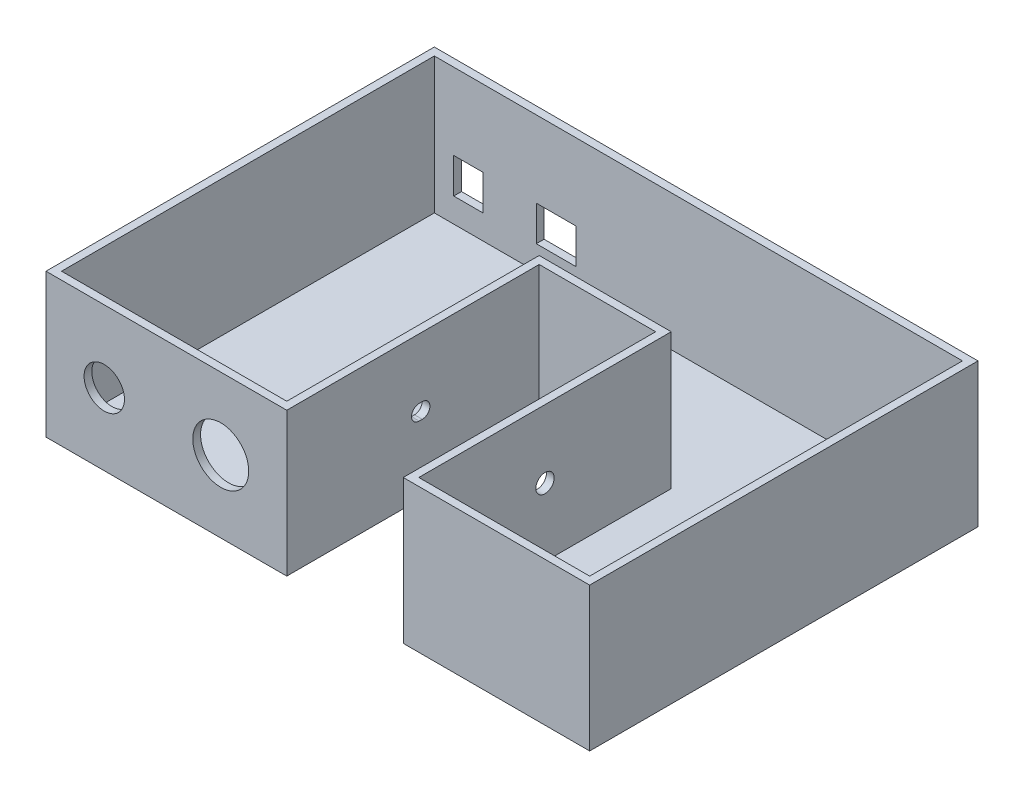
ISO-10303-21;
HEADER;
FILE_DESCRIPTION(('STEP AP214'),'2;1');
FILE_NAME('part.step','',(''),(''),'','','');
FILE_SCHEMA(('AUTOMOTIVE_DESIGN { 1 0 10303 214 1 1 1 1 }'));
ENDSEC;
DATA;
#1=APPLICATION_CONTEXT('core data for automotive mechanical design processes');
#2=APPLICATION_PROTOCOL_DEFINITION('international standard','automotive_design',2000,#1);
#3=PRODUCT_CONTEXT('',#1,'mechanical');
#4=PRODUCT('Part','Part','',(#3));
#5=PRODUCT_RELATED_PRODUCT_CATEGORY('part','',(#4));
#6=PRODUCT_DEFINITION_FORMATION('','',#4);
#7=PRODUCT_DEFINITION_CONTEXT('part definition',#1,'design');
#8=PRODUCT_DEFINITION('design','',#6,#7);
#9=PRODUCT_DEFINITION_SHAPE('','',#8);
#10=(LENGTH_UNIT() NAMED_UNIT(*) SI_UNIT(.MILLI.,.METRE.));
#11=(NAMED_UNIT(*) PLANE_ANGLE_UNIT() SI_UNIT($,.RADIAN.));
#12=(NAMED_UNIT(*) SI_UNIT($,.STERADIAN.) SOLID_ANGLE_UNIT());
#13=UNCERTAINTY_MEASURE_WITH_UNIT(LENGTH_MEASURE(1.E-05),#10,'distance_accuracy_value','');
#14=(GEOMETRIC_REPRESENTATION_CONTEXT(3) GLOBAL_UNCERTAINTY_ASSIGNED_CONTEXT((#13)) GLOBAL_UNIT_ASSIGNED_CONTEXT((#10,
#11,#12)) REPRESENTATION_CONTEXT('',''));
#15=CARTESIAN_POINT('',(0.,0.,0.));
#16=DIRECTION('',(0.,0.,1.));
#17=DIRECTION('',(1.,0.,0.));
#18=AXIS2_PLACEMENT_3D('',#15,#16,#17);
#19=CARTESIAN_POINT('',(0.,2.54,0.));
#20=DIRECTION('',(0.,0.,-1.));
#21=DIRECTION('',(-1.,0.,0.));
#22=AXIS2_PLACEMENT_3D('',#19,#20,#21);
#23=PLANE('',#22);
#24=CARTESIAN_POINT('',(19.05,23.495,0.));
#25=DIRECTION('',(0.,0.,1.));
#26=DIRECTION('',(1.,0.,0.));
#27=AXIS2_PLACEMENT_3D('',#24,#25,#26);
#28=CIRCLE('',#27,6.604);
#29=CARTESIAN_POINT('',(25.654,23.495,0.));
#30=VERTEX_POINT('',#29);
#31=EDGE_CURVE('E582',#30,#30,#28,.T.);
#32=ORIENTED_EDGE('',*,*,#31,.F.);
#33=EDGE_LOOP('',(#32));
#34=FACE_BOUND('',#33,.T.);
#35=CARTESIAN_POINT('',(57.15,23.495,0.));
#36=DIRECTION('',(0.,0.,1.));
#37=DIRECTION('',(1.,0.,0.));
#38=AXIS2_PLACEMENT_3D('',#35,#36,#37);
#39=CIRCLE('',#38,9.14400000000001);
#40=CARTESIAN_POINT('',(66.294,23.495,0.));
#41=VERTEX_POINT('',#40);
#42=EDGE_CURVE('E584',#41,#41,#39,.T.);
#43=ORIENTED_EDGE('',*,*,#42,.F.);
#44=EDGE_LOOP('',(#43));
#45=FACE_BOUND('',#44,.T.);
#46=DIRECTION('',(1.,0.,0.));
#47=VECTOR('',#46,1.);
#48=CARTESIAN_POINT('',(0.,0.,0.));
#49=LINE('',#48,#47);
#50=CARTESIAN_POINT('',(0.,0.,0.));
#51=VERTEX_POINT('',#50);
#52=CARTESIAN_POINT('',(78.74,0.,0.));
#53=VERTEX_POINT('',#52);
#54=EDGE_CURVE('E393',#51,#53,#49,.T.);
#55=ORIENTED_EDGE('',*,*,#54,.T.);
#56=DIRECTION('',(0.,-1.,0.));
#57=VECTOR('',#56,1.);
#58=CARTESIAN_POINT('',(78.74,2.54,0.));
#59=LINE('',#58,#57);
#60=CARTESIAN_POINT('',(78.74,46.99,0.));
#61=VERTEX_POINT('',#60);
#62=EDGE_CURVE('E11',#61,#53,#59,.T.);
#63=ORIENTED_EDGE('',*,*,#62,.F.);
#64=DIRECTION('',(1.,0.,0.));
#65=VECTOR('',#64,1.);
#66=CARTESIAN_POINT('',(0.,46.99,0.));
#67=LINE('',#66,#65);
#68=CARTESIAN_POINT('',(0.,46.99,0.));
#69=VERTEX_POINT('',#68);
#70=EDGE_CURVE('E375',#69,#61,#67,.T.);
#71=ORIENTED_EDGE('',*,*,#70,.F.);
#72=DIRECTION('',(0.,-1.,0.));
#73=VECTOR('',#72,1.);
#74=CARTESIAN_POINT('',(0.,2.54,0.));
#75=LINE('',#74,#73);
#76=EDGE_CURVE('E414',#69,#51,#75,.T.);
#77=ORIENTED_EDGE('',*,*,#76,.T.);
#78=EDGE_LOOP('',(#55,#63,#71,#77));
#79=FACE_BOUND('',#78,.T.);
#80=ADVANCED_FACE('F35',(#34,#45,#79),#23,.F.);
#81=CARTESIAN_POINT('',(78.74,2.54,0.));
#82=DIRECTION('',(-1.,0.,0.));
#83=DIRECTION('',(0.,0.,1.));
#84=AXIS2_PLACEMENT_3D('',#81,#82,#83);
#85=PLANE('',#84);
#86=DIRECTION('',(0.,0.,1.));
#87=VECTOR('',#86,1.);
#88=CARTESIAN_POINT('',(78.74,27.265,-44.315));
#89=LINE('',#88,#87);
#90=CARTESIAN_POINT('',(78.74,27.265,-44.315));
#91=VERTEX_POINT('',#90);
#92=CARTESIAN_POINT('',(78.74,27.265,-43.315));
#93=VERTEX_POINT('',#92);
#94=EDGE_CURVE('E223',#91,#93,#89,.T.);
#95=ORIENTED_EDGE('',*,*,#94,.F.);
#96=CARTESIAN_POINT('',(78.74,24.765,-44.315));
#97=DIRECTION('',(-1.,0.,0.));
#98=DIRECTION('',(0.,0.,1.));
#99=AXIS2_PLACEMENT_3D('',#96,#97,#98);
#100=CIRCLE('',#99,2.5);
#101=CARTESIAN_POINT('',(78.74,22.265,-44.315));
#102=VERTEX_POINT('',#101);
#103=EDGE_CURVE('E230',#102,#91,#100,.F.);
#104=ORIENTED_EDGE('',*,*,#103,.F.);
#105=DIRECTION('',(0.,0.,-1.));
#106=VECTOR('',#105,1.);
#107=CARTESIAN_POINT('',(78.74,22.265,-44.315));
#108=LINE('',#107,#106);
#109=CARTESIAN_POINT('',(78.74,22.265,-43.315));
#110=VERTEX_POINT('',#109);
#111=EDGE_CURVE('E235',#110,#102,#108,.T.);
#112=ORIENTED_EDGE('',*,*,#111,.F.);
#113=CARTESIAN_POINT('',(78.74,24.765,-43.315));
#114=DIRECTION('',(-1.,0.,0.));
#115=DIRECTION('',(0.,0.,1.));
#116=AXIS2_PLACEMENT_3D('',#113,#114,#115);
#117=CIRCLE('',#116,2.5);
#118=EDGE_CURVE('E49',#93,#110,#117,.F.);
#119=ORIENTED_EDGE('',*,*,#118,.F.);
#120=EDGE_LOOP('',(#95,#104,#112,#119));
#121=FACE_BOUND('',#120,.T.);
#122=DIRECTION('',(0.,0.,-1.));
#123=VECTOR('',#122,1.);
#124=CARTESIAN_POINT('',(78.74,0.,0.));
#125=LINE('',#124,#123);
#126=CARTESIAN_POINT('',(78.74,0.,-82.55));
#127=VERTEX_POINT('',#126);
#128=EDGE_CURVE('E396',#53,#127,#125,.T.);
#129=ORIENTED_EDGE('',*,*,#128,.T.);
#130=DIRECTION('',(0.,-1.,0.));
#131=VECTOR('',#130,1.);
#132=CARTESIAN_POINT('',(78.74,2.54,-82.55));
#133=LINE('',#132,#131);
#134=CARTESIAN_POINT('',(78.74,46.99,-82.55));
#135=VERTEX_POINT('',#134);
#136=EDGE_CURVE('E42',#135,#127,#133,.T.);
#137=ORIENTED_EDGE('',*,*,#136,.F.);
#138=DIRECTION('',(0.,0.,-1.));
#139=VECTOR('',#138,1.);
#140=CARTESIAN_POINT('',(78.74,46.99,0.));
#141=LINE('',#140,#139);
#142=EDGE_CURVE('E378',#61,#135,#141,.T.);
#143=ORIENTED_EDGE('',*,*,#142,.F.);
#144=ORIENTED_EDGE('',*,*,#62,.T.);
#145=EDGE_LOOP('',(#129,#137,#143,#144));
#146=FACE_BOUND('',#145,.T.);
#147=ADVANCED_FACE('F237',(#121,#146),#85,.F.);
#148=CARTESIAN_POINT('',(0.,2.54,-82.55));
#149=DIRECTION('',(0.,0.,-1.));
#150=DIRECTION('',(-1.,0.,0.));
#151=AXIS2_PLACEMENT_3D('',#148,#149,#150);
#152=PLANE('',#151);
#153=DIRECTION('',(1.,0.,0.));
#154=VECTOR('',#153,1.);
#155=CARTESIAN_POINT('',(0.,0.,-82.55));
#156=LINE('',#155,#154);
#157=CARTESIAN_POINT('',(116.84,0.,-82.55));
#158=VERTEX_POINT('',#157);
#159=EDGE_CURVE('E398',#127,#158,#156,.T.);
#160=ORIENTED_EDGE('',*,*,#159,.T.);
#161=DIRECTION('',(0.,-1.,0.));
#162=VECTOR('',#161,1.);
#163=CARTESIAN_POINT('',(116.84,2.54,-82.55));
#164=LINE('',#163,#162);
#165=CARTESIAN_POINT('',(116.84,46.99,-82.55));
#166=VERTEX_POINT('',#165);
#167=EDGE_CURVE('E425',#166,#158,#164,.T.);
#168=ORIENTED_EDGE('',*,*,#167,.F.);
#169=DIRECTION('',(1.,0.,0.));
#170=VECTOR('',#169,1.);
#171=CARTESIAN_POINT('',(78.74,46.99,-82.55));
#172=LINE('',#171,#170);
#173=EDGE_CURVE('E381',#135,#166,#172,.T.);
#174=ORIENTED_EDGE('',*,*,#173,.F.);
#175=ORIENTED_EDGE('',*,*,#136,.T.);
#176=EDGE_LOOP('',(#160,#168,#174,#175));
#177=FACE_BOUND('',#176,.T.);
#178=ADVANCED_FACE('F431',(#177),#152,.F.);
#179=CARTESIAN_POINT('',(116.84,2.54,0.));
#180=DIRECTION('',(1.,0.,0.));
#181=DIRECTION('',(0.,0.,-1.));
#182=AXIS2_PLACEMENT_3D('',#179,#180,#181);
#183=PLANE('',#182);
#184=CARTESIAN_POINT('',(116.84,24.765,-43.815));
#185=DIRECTION('',(1.,0.,0.));
#186=DIRECTION('',(0.,0.,-1.));
#187=AXIS2_PLACEMENT_3D('',#184,#185,#186);
#188=CIRCLE('',#187,3.);
#189=CARTESIAN_POINT('',(116.84,24.765,-46.8150000000001));
#190=VERTEX_POINT('',#189);
#191=EDGE_CURVE('E244',#190,#190,#188,.F.);
#192=ORIENTED_EDGE('',*,*,#191,.F.);
#193=EDGE_LOOP('',(#192));
#194=FACE_BOUND('',#193,.T.);
#195=DIRECTION('',(0.,0.,1.));
#196=VECTOR('',#195,1.);
#197=CARTESIAN_POINT('',(116.84,0.,0.));
#198=LINE('',#197,#196);
#199=CARTESIAN_POINT('',(116.84,0.,0.));
#200=VERTEX_POINT('',#199);
#201=EDGE_CURVE('E400',#158,#200,#198,.T.);
#202=ORIENTED_EDGE('',*,*,#201,.T.);
#203=DIRECTION('',(0.,-1.,0.));
#204=VECTOR('',#203,1.);
#205=CARTESIAN_POINT('',(116.84,2.54,0.));
#206=LINE('',#205,#204);
#207=CARTESIAN_POINT('',(116.84,46.99,0.));
#208=VERTEX_POINT('',#207);
#209=EDGE_CURVE('E422',#208,#200,#206,.T.);
#210=ORIENTED_EDGE('',*,*,#209,.F.);
#211=DIRECTION('',(0.,0.,1.));
#212=VECTOR('',#211,1.);
#213=CARTESIAN_POINT('',(116.84,46.99,-82.55));
#214=LINE('',#213,#212);
#215=EDGE_CURVE('E384',#166,#208,#214,.T.);
#216=ORIENTED_EDGE('',*,*,#215,.F.);
#217=ORIENTED_EDGE('',*,*,#167,.T.);
#218=EDGE_LOOP('',(#202,#210,#216,#217));
#219=FACE_BOUND('',#218,.T.);
#220=ADVANCED_FACE('F439',(#194,#219),#183,.F.);
#221=CARTESIAN_POINT('',(0.,2.54,0.));
#222=DIRECTION('',(0.,0.,-1.));
#223=DIRECTION('',(-1.,0.,0.));
#224=AXIS2_PLACEMENT_3D('',#221,#222,#223);
#225=PLANE('',#224);
#226=DIRECTION('',(1.,0.,0.));
#227=VECTOR('',#226,1.);
#228=CARTESIAN_POINT('',(0.,0.,0.));
#229=LINE('',#228,#227);
#230=CARTESIAN_POINT('',(177.8,0.,0.));
#231=VERTEX_POINT('',#230);
#232=EDGE_CURVE('E402',#200,#231,#229,.T.);
#233=ORIENTED_EDGE('',*,*,#232,.T.);
#234=DIRECTION('',(0.,-1.,0.));
#235=VECTOR('',#234,1.);
#236=CARTESIAN_POINT('',(177.8,2.54,0.));
#237=LINE('',#236,#235);
#238=CARTESIAN_POINT('',(177.8,46.99,0.));
#239=VERTEX_POINT('',#238);
#240=EDGE_CURVE('E420',#239,#231,#237,.T.);
#241=ORIENTED_EDGE('',*,*,#240,.F.);
#242=DIRECTION('',(1.,0.,0.));
#243=VECTOR('',#242,1.);
#244=CARTESIAN_POINT('',(116.84,46.99,0.));
#245=LINE('',#244,#243);
#246=EDGE_CURVE('E387',#208,#239,#245,.T.);
#247=ORIENTED_EDGE('',*,*,#246,.F.);
#248=ORIENTED_EDGE('',*,*,#209,.T.);
#249=EDGE_LOOP('',(#233,#241,#247,#248));
#250=FACE_BOUND('',#249,.T.);
#251=ADVANCED_FACE('F443',(#250),#225,.F.);
#252=CARTESIAN_POINT('',(177.8,2.54,0.));
#253=DIRECTION('',(1.,0.,0.));
#254=DIRECTION('',(0.,0.,-1.));
#255=AXIS2_PLACEMENT_3D('',#252,#253,#254);
#256=PLANE('',#255);
#257=DIRECTION('',(0.,0.,1.));
#258=VECTOR('',#257,1.);
#259=CARTESIAN_POINT('',(177.8,0.,0.));
#260=LINE('',#259,#258);
#261=CARTESIAN_POINT('',(177.8,0.,-127.));
#262=VERTEX_POINT('',#261);
#263=EDGE_CURVE('E405',#262,#231,#260,.T.);
#264=ORIENTED_EDGE('',*,*,#263,.F.);
#265=DIRECTION('',(0.,-1.,0.));
#266=VECTOR('',#265,1.);
#267=CARTESIAN_POINT('',(177.8,2.54,-127.));
#268=LINE('',#267,#266);
#269=CARTESIAN_POINT('',(177.8,46.99,-127.));
#270=VERTEX_POINT('',#269);
#271=EDGE_CURVE('E418',#270,#262,#268,.T.);
#272=ORIENTED_EDGE('',*,*,#271,.F.);
#273=DIRECTION('',(0.,0.,-1.));
#274=VECTOR('',#273,1.);
#275=CARTESIAN_POINT('',(177.8,46.99,0.));
#276=LINE('',#275,#274);
#277=EDGE_CURVE('E390',#239,#270,#276,.T.);
#278=ORIENTED_EDGE('',*,*,#277,.F.);
#279=ORIENTED_EDGE('',*,*,#240,.T.);
#280=EDGE_LOOP('',(#264,#272,#278,#279));
#281=FACE_BOUND('',#280,.T.);
#282=ADVANCED_FACE('F451',(#281),#256,.T.);
#283=CARTESIAN_POINT('',(0.,2.54,-127.));
#284=DIRECTION('',(0.,0.,-1.));
#285=DIRECTION('',(-1.,0.,0.));
#286=AXIS2_PLACEMENT_3D('',#283,#284,#285);
#287=PLANE('',#286);
#288=DIRECTION('',(1.,0.,0.));
#289=VECTOR('',#288,1.);
#290=CARTESIAN_POINT('',(35.89,21.99,-127.));
#291=LINE('',#290,#289);
#292=CARTESIAN_POINT('',(35.89,21.99,-127.));
#293=VERTEX_POINT('',#292);
#294=CARTESIAN_POINT('',(48.89,21.99,-127.));
#295=VERTEX_POINT('',#294);
#296=EDGE_CURVE('E260',#293,#295,#291,.T.);
#297=ORIENTED_EDGE('',*,*,#296,.F.);
#298=DIRECTION('',(0.,1.,0.));
#299=VECTOR('',#298,1.);
#300=CARTESIAN_POINT('',(35.89,10.49,-127.));
#301=LINE('',#300,#299);
#302=CARTESIAN_POINT('',(35.89,10.49,-127.));
#303=VERTEX_POINT('',#302);
#304=EDGE_CURVE('E257',#303,#293,#301,.T.);
#305=ORIENTED_EDGE('',*,*,#304,.F.);
#306=DIRECTION('',(-1.,0.,0.));
#307=VECTOR('',#306,1.);
#308=CARTESIAN_POINT('',(35.89,10.49,-127.));
#309=LINE('',#308,#307);
#310=CARTESIAN_POINT('',(48.89,10.49,-127.));
#311=VERTEX_POINT('',#310);
#312=EDGE_CURVE('E266',#311,#303,#309,.T.);
#313=ORIENTED_EDGE('',*,*,#312,.F.);
#314=DIRECTION('',(0.,-1.,0.));
#315=VECTOR('',#314,1.);
#316=CARTESIAN_POINT('',(48.89,10.49,-127.));
#317=LINE('',#316,#315);
#318=EDGE_CURVE('E263',#295,#311,#317,.T.);
#319=ORIENTED_EDGE('',*,*,#318,.F.);
#320=EDGE_LOOP('',(#297,#305,#313,#319));
#321=FACE_BOUND('',#320,.T.);
#322=DIRECTION('',(1.,0.,0.));
#323=VECTOR('',#322,1.);
#324=CARTESIAN_POINT('',(8.89000000000001,21.99,-127.));
#325=LINE('',#324,#323);
#326=CARTESIAN_POINT('',(8.89000000000001,21.99,-127.));
#327=VERTEX_POINT('',#326);
#328=CARTESIAN_POINT('',(18.39,21.99,-127.));
#329=VERTEX_POINT('',#328);
#330=EDGE_CURVE('E292',#327,#329,#325,.T.);
#331=ORIENTED_EDGE('',*,*,#330,.F.);
#332=DIRECTION('',(0.,1.,0.));
#333=VECTOR('',#332,1.);
#334=CARTESIAN_POINT('',(8.89000000000001,21.99,-127.));
#335=LINE('',#334,#333);
#336=CARTESIAN_POINT('',(8.89000000000001,10.49,-127.));
#337=VERTEX_POINT('',#336);
#338=EDGE_CURVE('E289',#337,#327,#335,.T.);
#339=ORIENTED_EDGE('',*,*,#338,.F.);
#340=DIRECTION('',(-1.,0.,0.));
#341=VECTOR('',#340,1.);
#342=CARTESIAN_POINT('',(8.89000000000001,10.49,-127.));
#343=LINE('',#342,#341);
#344=CARTESIAN_POINT('',(18.39,10.49,-127.));
#345=VERTEX_POINT('',#344);
#346=EDGE_CURVE('E298',#345,#337,#343,.T.);
#347=ORIENTED_EDGE('',*,*,#346,.F.);
#348=DIRECTION('',(0.,-1.,0.));
#349=VECTOR('',#348,1.);
#350=CARTESIAN_POINT('',(18.39,21.99,-127.));
#351=LINE('',#350,#349);
#352=EDGE_CURVE('E295',#329,#345,#351,.T.);
#353=ORIENTED_EDGE('',*,*,#352,.F.);
#354=EDGE_LOOP('',(#331,#339,#347,#353));
#355=FACE_BOUND('',#354,.T.);
#356=DIRECTION('',(1.,0.,0.));
#357=VECTOR('',#356,1.);
#358=CARTESIAN_POINT('',(0.,0.,-127.));
#359=LINE('',#358,#357);
#360=CARTESIAN_POINT('',(0.,0.,-127.));
#361=VERTEX_POINT('',#360);
#362=EDGE_CURVE('E408',#361,#262,#359,.T.);
#363=ORIENTED_EDGE('',*,*,#362,.F.);
#364=DIRECTION('',(0.,-1.,0.));
#365=VECTOR('',#364,1.);
#366=CARTESIAN_POINT('',(0.,2.54,-127.));
#367=LINE('',#366,#365);
#368=CARTESIAN_POINT('',(0.,46.99,-127.));
#369=VERTEX_POINT('',#368);
#370=EDGE_CURVE('E416',#369,#361,#367,.T.);
#371=ORIENTED_EDGE('',*,*,#370,.F.);
#372=DIRECTION('',(-1.,0.,0.));
#373=VECTOR('',#372,1.);
#374=CARTESIAN_POINT('',(177.8,46.99,-127.));
#375=LINE('',#374,#373);
#376=EDGE_CURVE('E369',#270,#369,#375,.T.);
#377=ORIENTED_EDGE('',*,*,#376,.F.);
#378=ORIENTED_EDGE('',*,*,#271,.T.);
#379=EDGE_LOOP('',(#363,#371,#377,#378));
#380=FACE_BOUND('',#379,.T.);
#381=ADVANCED_FACE('F454',(#321,#355,#380),#287,.T.);
#382=CARTESIAN_POINT('',(0.,2.54,0.));
#383=DIRECTION('',(-1.,0.,0.));
#384=DIRECTION('',(0.,0.,1.));
#385=AXIS2_PLACEMENT_3D('',#382,#383,#384);
#386=PLANE('',#385);
#387=DIRECTION('',(0.,0.,-1.));
#388=VECTOR('',#387,1.);
#389=CARTESIAN_POINT('',(0.,0.,0.));
#390=LINE('',#389,#388);
#391=EDGE_CURVE('E411',#51,#361,#390,.T.);
#392=ORIENTED_EDGE('',*,*,#391,.F.);
#393=ORIENTED_EDGE('',*,*,#76,.F.);
#394=DIRECTION('',(0.,0.,1.));
#395=VECTOR('',#394,1.);
#396=CARTESIAN_POINT('',(0.,46.99,-127.));
#397=LINE('',#396,#395);
#398=EDGE_CURVE('E372',#369,#69,#397,.T.);
#399=ORIENTED_EDGE('',*,*,#398,.F.);
#400=ORIENTED_EDGE('',*,*,#370,.T.);
#401=EDGE_LOOP('',(#392,#393,#399,#400));
#402=FACE_BOUND('',#401,.T.);
#403=ADVANCED_FACE('F476',(#402),#386,.T.);
#404=CARTESIAN_POINT('',(0.,0.,0.));
#405=DIRECTION('',(0.,1.,0.));
#406=DIRECTION('',(0.,0.,1.));
#407=AXIS2_PLACEMENT_3D('',#404,#405,#406);
#408=PLANE('',#407);
#409=ORIENTED_EDGE('',*,*,#54,.F.);
#410=ORIENTED_EDGE('',*,*,#391,.T.);
#411=ORIENTED_EDGE('',*,*,#362,.T.);
#412=ORIENTED_EDGE('',*,*,#263,.T.);
#413=ORIENTED_EDGE('',*,*,#232,.F.);
#414=ORIENTED_EDGE('',*,*,#201,.F.);
#415=ORIENTED_EDGE('',*,*,#159,.F.);
#416=ORIENTED_EDGE('',*,*,#128,.F.);
#417=EDGE_LOOP('',(#409,#410,#411,#412,#413,#414,#415,#416));
#418=FACE_BOUND('',#417,.T.);
#419=ADVANCED_FACE('F436',(#418),#408,.F.);
#420=CARTESIAN_POINT('',(0.,46.99,0.));
#421=DIRECTION('',(0.,1.,0.));
#422=DIRECTION('',(0.,0.,1.));
#423=AXIS2_PLACEMENT_3D('',#420,#421,#422);
#424=PLANE('',#423);
#425=ORIENTED_EDGE('',*,*,#376,.T.);
#426=ORIENTED_EDGE('',*,*,#398,.T.);
#427=ORIENTED_EDGE('',*,*,#70,.T.);
#428=ORIENTED_EDGE('',*,*,#142,.T.);
#429=ORIENTED_EDGE('',*,*,#173,.T.);
#430=ORIENTED_EDGE('',*,*,#215,.T.);
#431=ORIENTED_EDGE('',*,*,#246,.T.);
#432=ORIENTED_EDGE('',*,*,#277,.T.);
#433=EDGE_LOOP('',(#425,#426,#427,#428,#429,#430,#431,#432));
#434=FACE_BOUND('',#433,.T.);
#435=DIRECTION('',(1.,0.,0.));
#436=VECTOR('',#435,1.);
#437=CARTESIAN_POINT('',(2.54000000000001,46.99,-2.54));
#438=LINE('',#437,#436);
#439=CARTESIAN_POINT('',(2.54000000000001,46.99,-2.54));
#440=VERTEX_POINT('',#439);
#441=CARTESIAN_POINT('',(76.2,46.99,-2.54));
#442=VERTEX_POINT('',#441);
#443=EDGE_CURVE('E315',#440,#442,#438,.T.);
#444=ORIENTED_EDGE('',*,*,#443,.F.);
#445=DIRECTION('',(0.,0.,1.));
#446=VECTOR('',#445,1.);
#447=CARTESIAN_POINT('',(2.54,46.99,-124.46));
#448=LINE('',#447,#446);
#449=CARTESIAN_POINT('',(2.54,46.99,-124.46));
#450=VERTEX_POINT('',#449);
#451=EDGE_CURVE('E313',#450,#440,#448,.T.);
#452=ORIENTED_EDGE('',*,*,#451,.F.);
#453=DIRECTION('',(-1.,0.,0.));
#454=VECTOR('',#453,1.);
#455=CARTESIAN_POINT('',(2.54,46.99,-124.46));
#456=LINE('',#455,#454);
#457=CARTESIAN_POINT('',(175.26,46.99,-124.46));
#458=VERTEX_POINT('',#457);
#459=EDGE_CURVE('E329',#458,#450,#456,.T.);
#460=ORIENTED_EDGE('',*,*,#459,.F.);
#461=DIRECTION('',(0.,0.,-1.));
#462=VECTOR('',#461,1.);
#463=CARTESIAN_POINT('',(175.26,46.99,-124.46));
#464=LINE('',#463,#462);
#465=CARTESIAN_POINT('',(175.26,46.99,-2.54));
#466=VERTEX_POINT('',#465);
#467=EDGE_CURVE('E326',#466,#458,#464,.T.);
#468=ORIENTED_EDGE('',*,*,#467,.F.);
#469=DIRECTION('',(1.,0.,0.));
#470=VECTOR('',#469,1.);
#471=CARTESIAN_POINT('',(119.38,46.99,-2.54));
#472=LINE('',#471,#470);
#473=CARTESIAN_POINT('',(119.38,46.99,-2.54));
#474=VERTEX_POINT('',#473);
#475=EDGE_CURVE('E324',#474,#466,#472,.T.);
#476=ORIENTED_EDGE('',*,*,#475,.F.);
#477=DIRECTION('',(0.,0.,1.));
#478=VECTOR('',#477,1.);
#479=CARTESIAN_POINT('',(119.38,46.99,-85.09));
#480=LINE('',#479,#478);
#481=CARTESIAN_POINT('',(119.38,46.99,-85.09));
#482=VERTEX_POINT('',#481);
#483=EDGE_CURVE('E322',#482,#474,#480,.T.);
#484=ORIENTED_EDGE('',*,*,#483,.F.);
#485=DIRECTION('',(1.,0.,0.));
#486=VECTOR('',#485,1.);
#487=CARTESIAN_POINT('',(76.2,46.99,-85.09));
#488=LINE('',#487,#486);
#489=CARTESIAN_POINT('',(76.2,46.99,-85.09));
#490=VERTEX_POINT('',#489);
#491=EDGE_CURVE('E320',#490,#482,#488,.T.);
#492=ORIENTED_EDGE('',*,*,#491,.F.);
#493=DIRECTION('',(0.,0.,-1.));
#494=VECTOR('',#493,1.);
#495=CARTESIAN_POINT('',(76.2,46.99,-85.09));
#496=LINE('',#495,#494);
#497=EDGE_CURVE('E318',#442,#490,#496,.T.);
#498=ORIENTED_EDGE('',*,*,#497,.F.);
#499=EDGE_LOOP('',(#444,#452,#460,#468,#476,#484,#492,#498));
#500=FACE_BOUND('',#499,.T.);
#501=ADVANCED_FACE('F446',(#434,#500),#424,.T.);
#502=CARTESIAN_POINT('',(2.54,46.99,-124.46));
#503=DIRECTION('',(1.,0.,0.));
#504=DIRECTION('',(0.,0.,-1.));
#505=AXIS2_PLACEMENT_3D('',#502,#503,#504);
#506=PLANE('',#505);
#507=DIRECTION('',(0.,0.,1.));
#508=VECTOR('',#507,1.);
#509=CARTESIAN_POINT('',(2.54,2.54,-124.46));
#510=LINE('',#509,#508);
#511=CARTESIAN_POINT('',(2.54,2.54,-124.46));
#512=VERTEX_POINT('',#511);
#513=CARTESIAN_POINT('',(2.54000000000001,2.54,-2.54));
#514=VERTEX_POINT('',#513);
#515=EDGE_CURVE('E312',#512,#514,#510,.T.);
#516=ORIENTED_EDGE('',*,*,#515,.F.);
#517=DIRECTION('',(0.,-1.,0.));
#518=VECTOR('',#517,1.);
#519=CARTESIAN_POINT('',(2.54,46.99,-124.46));
#520=LINE('',#519,#518);
#521=EDGE_CURVE('E331',#450,#512,#520,.T.);
#522=ORIENTED_EDGE('',*,*,#521,.F.);
#523=ORIENTED_EDGE('',*,*,#451,.T.);
#524=DIRECTION('',(0.,-1.,0.));
#525=VECTOR('',#524,1.);
#526=CARTESIAN_POINT('',(2.54000000000001,46.99,-2.54));
#527=LINE('',#526,#525);
#528=EDGE_CURVE('E366',#440,#514,#527,.T.);
#529=ORIENTED_EDGE('',*,*,#528,.T.);
#530=EDGE_LOOP('',(#516,#522,#523,#529));
#531=FACE_BOUND('',#530,.T.);
#532=ADVANCED_FACE('F490',(#531),#506,.T.);
#533=CARTESIAN_POINT('',(2.54000000000001,46.99,-2.54));
#534=DIRECTION('',(0.,0.,-1.));
#535=DIRECTION('',(-1.,0.,0.));
#536=AXIS2_PLACEMENT_3D('',#533,#534,#535);
#537=PLANE('',#536);
#538=CARTESIAN_POINT('',(19.05,23.495,-2.54));
#539=DIRECTION('',(0.,0.,1.));
#540=DIRECTION('',(1.,0.,0.));
#541=AXIS2_PLACEMENT_3D('',#538,#539,#540);
#542=CIRCLE('',#541,6.604);
#543=CARTESIAN_POINT('',(25.654,23.495,-2.54));
#544=VERTEX_POINT('',#543);
#545=EDGE_CURVE('E579',#544,#544,#542,.T.);
#546=ORIENTED_EDGE('',*,*,#545,.T.);
#547=EDGE_LOOP('',(#546));
#548=FACE_BOUND('',#547,.T.);
#549=CARTESIAN_POINT('',(57.15,23.495,-2.54));
#550=DIRECTION('',(0.,0.,1.));
#551=DIRECTION('',(1.,0.,0.));
#552=AXIS2_PLACEMENT_3D('',#549,#550,#551);
#553=CIRCLE('',#552,9.14400000000001);
#554=CARTESIAN_POINT('',(66.294,23.495,-2.54));
#555=VERTEX_POINT('',#554);
#556=EDGE_CURVE('E587',#555,#555,#553,.T.);
#557=ORIENTED_EDGE('',*,*,#556,.T.);
#558=EDGE_LOOP('',(#557));
#559=FACE_BOUND('',#558,.T.);
#560=DIRECTION('',(1.,0.,0.));
#561=VECTOR('',#560,1.);
#562=CARTESIAN_POINT('',(2.54000000000001,2.54,-2.54));
#563=LINE('',#562,#561);
#564=CARTESIAN_POINT('',(76.2,2.54,-2.54));
#565=VERTEX_POINT('',#564);
#566=EDGE_CURVE('E333',#514,#565,#563,.T.);
#567=ORIENTED_EDGE('',*,*,#566,.F.);
#568=ORIENTED_EDGE('',*,*,#528,.F.);
#569=ORIENTED_EDGE('',*,*,#443,.T.);
#570=DIRECTION('',(0.,-1.,0.));
#571=VECTOR('',#570,1.);
#572=CARTESIAN_POINT('',(76.2,46.99,-2.54));
#573=LINE('',#572,#571);
#574=EDGE_CURVE('E363',#442,#565,#573,.T.);
#575=ORIENTED_EDGE('',*,*,#574,.T.);
#576=EDGE_LOOP('',(#567,#568,#569,#575));
#577=FACE_BOUND('',#576,.T.);
#578=ADVANCED_FACE('F493',(#548,#559,#577),#537,.T.);
#579=CARTESIAN_POINT('',(76.2,46.99,-85.09));
#580=DIRECTION('',(-1.,0.,0.));
#581=DIRECTION('',(0.,0.,1.));
#582=AXIS2_PLACEMENT_3D('',#579,#580,#581);
#583=PLANE('',#582);
#584=CARTESIAN_POINT('',(76.2,24.765,-44.315));
#585=DIRECTION('',(-1.,0.,0.));
#586=DIRECTION('',(0.,0.,1.));
#587=AXIS2_PLACEMENT_3D('',#584,#585,#586);
#588=CIRCLE('',#587,2.5);
#589=CARTESIAN_POINT('',(76.2,27.265,-44.315));
#590=VERTEX_POINT('',#589);
#591=CARTESIAN_POINT('',(76.2,22.265,-44.315));
#592=VERTEX_POINT('',#591);
#593=EDGE_CURVE('E57',#590,#592,#588,.T.);
#594=ORIENTED_EDGE('',*,*,#593,.F.);
#595=DIRECTION('',(0.,0.,-1.));
#596=VECTOR('',#595,1.);
#597=CARTESIAN_POINT('',(76.2,27.265,-44.315));
#598=LINE('',#597,#596);
#599=CARTESIAN_POINT('',(76.2,27.265,-43.315));
#600=VERTEX_POINT('',#599);
#601=EDGE_CURVE('E225',#600,#590,#598,.T.);
#602=ORIENTED_EDGE('',*,*,#601,.F.);
#603=CARTESIAN_POINT('',(76.2,24.765,-43.315));
#604=DIRECTION('',(-1.,0.,0.));
#605=DIRECTION('',(0.,0.,1.));
#606=AXIS2_PLACEMENT_3D('',#603,#604,#605);
#607=CIRCLE('',#606,2.5);
#608=CARTESIAN_POINT('',(76.2,22.265,-43.315));
#609=VERTEX_POINT('',#608);
#610=EDGE_CURVE('E599',#609,#600,#607,.T.);
#611=ORIENTED_EDGE('',*,*,#610,.F.);
#612=DIRECTION('',(0.,0.,1.));
#613=VECTOR('',#612,1.);
#614=CARTESIAN_POINT('',(76.2,22.265,-44.315));
#615=LINE('',#614,#613);
#616=EDGE_CURVE('E602',#592,#609,#615,.T.);
#617=ORIENTED_EDGE('',*,*,#616,.F.);
#618=EDGE_LOOP('',(#594,#602,#611,#617));
#619=FACE_BOUND('',#618,.T.);
#620=DIRECTION('',(0.,0.,-1.));
#621=VECTOR('',#620,1.);
#622=CARTESIAN_POINT('',(76.2,2.54,-85.09));
#623=LINE('',#622,#621);
#624=CARTESIAN_POINT('',(76.2,2.54,-85.09));
#625=VERTEX_POINT('',#624);
#626=EDGE_CURVE('E335',#565,#625,#623,.T.);
#627=ORIENTED_EDGE('',*,*,#626,.F.);
#628=ORIENTED_EDGE('',*,*,#574,.F.);
#629=ORIENTED_EDGE('',*,*,#497,.T.);
#630=DIRECTION('',(0.,-1.,0.));
#631=VECTOR('',#630,1.);
#632=CARTESIAN_POINT('',(76.2,46.99,-85.09));
#633=LINE('',#632,#631);
#634=EDGE_CURVE('E360',#490,#625,#633,.T.);
#635=ORIENTED_EDGE('',*,*,#634,.T.);
#636=EDGE_LOOP('',(#627,#628,#629,#635));
#637=FACE_BOUND('',#636,.T.);
#638=ADVANCED_FACE('F497',(#619,#637),#583,.T.);
#639=CARTESIAN_POINT('',(76.2,46.99,-85.09));
#640=DIRECTION('',(0.,0.,-1.));
#641=DIRECTION('',(-1.,0.,0.));
#642=AXIS2_PLACEMENT_3D('',#639,#640,#641);
#643=PLANE('',#642);
#644=DIRECTION('',(1.,0.,0.));
#645=VECTOR('',#644,1.);
#646=CARTESIAN_POINT('',(76.2,2.54,-85.09));
#647=LINE('',#646,#645);
#648=CARTESIAN_POINT('',(119.38,2.54,-85.09));
#649=VERTEX_POINT('',#648);
#650=EDGE_CURVE('E337',#625,#649,#647,.T.);
#651=ORIENTED_EDGE('',*,*,#650,.F.);
#652=ORIENTED_EDGE('',*,*,#634,.F.);
#653=ORIENTED_EDGE('',*,*,#491,.T.);
#654=DIRECTION('',(0.,-1.,0.));
#655=VECTOR('',#654,1.);
#656=CARTESIAN_POINT('',(119.38,46.99,-85.09));
#657=LINE('',#656,#655);
#658=EDGE_CURVE('E357',#482,#649,#657,.T.);
#659=ORIENTED_EDGE('',*,*,#658,.T.);
#660=EDGE_LOOP('',(#651,#652,#653,#659));
#661=FACE_BOUND('',#660,.T.);
#662=ADVANCED_FACE('F501',(#661),#643,.T.);
#663=CARTESIAN_POINT('',(119.38,46.99,-85.09));
#664=DIRECTION('',(1.,0.,0.));
#665=DIRECTION('',(0.,0.,-1.));
#666=AXIS2_PLACEMENT_3D('',#663,#664,#665);
#667=PLANE('',#666);
#668=CARTESIAN_POINT('',(119.38,24.765,-43.815));
#669=DIRECTION('',(1.,0.,0.));
#670=DIRECTION('',(0.,0.,-1.));
#671=AXIS2_PLACEMENT_3D('',#668,#669,#670);
#672=CIRCLE('',#671,3.);
#673=CARTESIAN_POINT('',(119.38,24.765,-46.8150000000001));
#674=VERTEX_POINT('',#673);
#675=EDGE_CURVE('E590',#674,#674,#672,.T.);
#676=ORIENTED_EDGE('',*,*,#675,.F.);
#677=EDGE_LOOP('',(#676));
#678=FACE_BOUND('',#677,.T.);
#679=DIRECTION('',(0.,0.,1.));
#680=VECTOR('',#679,1.);
#681=CARTESIAN_POINT('',(119.38,2.54,-85.09));
#682=LINE('',#681,#680);
#683=CARTESIAN_POINT('',(119.38,2.54,-2.54));
#684=VERTEX_POINT('',#683);
#685=EDGE_CURVE('E339',#649,#684,#682,.T.);
#686=ORIENTED_EDGE('',*,*,#685,.F.);
#687=ORIENTED_EDGE('',*,*,#658,.F.);
#688=ORIENTED_EDGE('',*,*,#483,.T.);
#689=DIRECTION('',(0.,-1.,0.));
#690=VECTOR('',#689,1.);
#691=CARTESIAN_POINT('',(119.38,46.99,-2.54));
#692=LINE('',#691,#690);
#693=EDGE_CURVE('E354',#474,#684,#692,.T.);
#694=ORIENTED_EDGE('',*,*,#693,.T.);
#695=EDGE_LOOP('',(#686,#687,#688,#694));
#696=FACE_BOUND('',#695,.T.);
#697=ADVANCED_FACE('F505',(#678,#696),#667,.T.);
#698=CARTESIAN_POINT('',(119.38,46.99,-2.54));
#699=DIRECTION('',(0.,0.,-1.));
#700=DIRECTION('',(-1.,0.,0.));
#701=AXIS2_PLACEMENT_3D('',#698,#699,#700);
#702=PLANE('',#701);
#703=DIRECTION('',(1.,0.,0.));
#704=VECTOR('',#703,1.);
#705=CARTESIAN_POINT('',(119.38,2.54,-2.54));
#706=LINE('',#705,#704);
#707=CARTESIAN_POINT('',(175.26,2.54,-2.54));
#708=VERTEX_POINT('',#707);
#709=EDGE_CURVE('E341',#684,#708,#706,.T.);
#710=ORIENTED_EDGE('',*,*,#709,.F.);
#711=ORIENTED_EDGE('',*,*,#693,.F.);
#712=ORIENTED_EDGE('',*,*,#475,.T.);
#713=DIRECTION('',(0.,-1.,0.));
#714=VECTOR('',#713,1.);
#715=CARTESIAN_POINT('',(175.26,46.99,-2.54));
#716=LINE('',#715,#714);
#717=EDGE_CURVE('E351',#466,#708,#716,.T.);
#718=ORIENTED_EDGE('',*,*,#717,.T.);
#719=EDGE_LOOP('',(#710,#711,#712,#718));
#720=FACE_BOUND('',#719,.T.);
#721=ADVANCED_FACE('F509',(#720),#702,.T.);
#722=CARTESIAN_POINT('',(175.26,46.99,-124.46));
#723=DIRECTION('',(-1.,0.,0.));
#724=DIRECTION('',(0.,0.,1.));
#725=AXIS2_PLACEMENT_3D('',#722,#723,#724);
#726=PLANE('',#725);
#727=DIRECTION('',(0.,0.,-1.));
#728=VECTOR('',#727,1.);
#729=CARTESIAN_POINT('',(175.26,2.54,-124.46));
#730=LINE('',#729,#728);
#731=CARTESIAN_POINT('',(175.26,2.54,-124.46));
#732=VERTEX_POINT('',#731);
#733=EDGE_CURVE('E343',#708,#732,#730,.T.);
#734=ORIENTED_EDGE('',*,*,#733,.F.);
#735=ORIENTED_EDGE('',*,*,#717,.F.);
#736=ORIENTED_EDGE('',*,*,#467,.T.);
#737=DIRECTION('',(0.,-1.,0.));
#738=VECTOR('',#737,1.);
#739=CARTESIAN_POINT('',(175.26,46.99,-124.46));
#740=LINE('',#739,#738);
#741=EDGE_CURVE('E348',#458,#732,#740,.T.);
#742=ORIENTED_EDGE('',*,*,#741,.T.);
#743=EDGE_LOOP('',(#734,#735,#736,#742));
#744=FACE_BOUND('',#743,.T.);
#745=ADVANCED_FACE('F513',(#744),#726,.T.);
#746=CARTESIAN_POINT('',(2.54,46.99,-124.46));
#747=DIRECTION('',(0.,0.,1.));
#748=DIRECTION('',(1.,0.,0.));
#749=AXIS2_PLACEMENT_3D('',#746,#747,#748);
#750=PLANE('',#749);
#751=DIRECTION('',(1.,0.,0.));
#752=VECTOR('',#751,1.);
#753=CARTESIAN_POINT('',(35.89,21.99,-124.46));
#754=LINE('',#753,#752);
#755=CARTESIAN_POINT('',(35.89,21.99,-124.46));
#756=VERTEX_POINT('',#755);
#757=CARTESIAN_POINT('',(48.89,21.99,-124.46));
#758=VERTEX_POINT('',#757);
#759=EDGE_CURVE('E272',#756,#758,#754,.T.);
#760=ORIENTED_EDGE('',*,*,#759,.T.);
#761=DIRECTION('',(0.,-1.,0.));
#762=VECTOR('',#761,1.);
#763=CARTESIAN_POINT('',(48.89,10.49,-124.46));
#764=LINE('',#763,#762);
#765=CARTESIAN_POINT('',(48.89,10.49,-124.46));
#766=VERTEX_POINT('',#765);
#767=EDGE_CURVE('E240',#758,#766,#764,.T.);
#768=ORIENTED_EDGE('',*,*,#767,.T.);
#769=DIRECTION('',(-1.,0.,0.));
#770=VECTOR('',#769,1.);
#771=CARTESIAN_POINT('',(35.89,10.49,-124.46));
#772=LINE('',#771,#770);
#773=CARTESIAN_POINT('',(35.89,10.49,-124.46));
#774=VERTEX_POINT('',#773);
#775=EDGE_CURVE('E251',#766,#774,#772,.T.);
#776=ORIENTED_EDGE('',*,*,#775,.T.);
#777=DIRECTION('',(0.,1.,0.));
#778=VECTOR('',#777,1.);
#779=CARTESIAN_POINT('',(35.89,10.49,-124.46));
#780=LINE('',#779,#778);
#781=EDGE_CURVE('E254',#774,#756,#780,.T.);
#782=ORIENTED_EDGE('',*,*,#781,.T.);
#783=EDGE_LOOP('',(#760,#768,#776,#782));
#784=FACE_BOUND('',#783,.T.);
#785=DIRECTION('',(1.,0.,0.));
#786=VECTOR('',#785,1.);
#787=CARTESIAN_POINT('',(8.89000000000001,21.99,-124.46));
#788=LINE('',#787,#786);
#789=CARTESIAN_POINT('',(8.89000000000001,21.99,-124.46));
#790=VERTEX_POINT('',#789);
#791=CARTESIAN_POINT('',(18.39,21.99,-124.46));
#792=VERTEX_POINT('',#791);
#793=EDGE_CURVE('E304',#790,#792,#788,.T.);
#794=ORIENTED_EDGE('',*,*,#793,.T.);
#795=DIRECTION('',(0.,-1.,0.));
#796=VECTOR('',#795,1.);
#797=CARTESIAN_POINT('',(18.39,21.99,-124.46));
#798=LINE('',#797,#796);
#799=CARTESIAN_POINT('',(18.39,10.49,-124.46));
#800=VERTEX_POINT('',#799);
#801=EDGE_CURVE('E280',#792,#800,#798,.T.);
#802=ORIENTED_EDGE('',*,*,#801,.T.);
#803=DIRECTION('',(-1.,0.,0.));
#804=VECTOR('',#803,1.);
#805=CARTESIAN_POINT('',(8.89000000000001,10.49,-124.46));
#806=LINE('',#805,#804);
#807=CARTESIAN_POINT('',(8.89000000000001,10.49,-124.46));
#808=VERTEX_POINT('',#807);
#809=EDGE_CURVE('E283',#800,#808,#806,.T.);
#810=ORIENTED_EDGE('',*,*,#809,.T.);
#811=DIRECTION('',(0.,1.,0.));
#812=VECTOR('',#811,1.);
#813=CARTESIAN_POINT('',(8.89000000000001,21.99,-124.46));
#814=LINE('',#813,#812);
#815=EDGE_CURVE('E286',#808,#790,#814,.T.);
#816=ORIENTED_EDGE('',*,*,#815,.T.);
#817=EDGE_LOOP('',(#794,#802,#810,#816));
#818=FACE_BOUND('',#817,.T.);
#819=DIRECTION('',(-1.,0.,0.));
#820=VECTOR('',#819,1.);
#821=CARTESIAN_POINT('',(2.54,2.54,-124.46));
#822=LINE('',#821,#820);
#823=EDGE_CURVE('E316',#732,#512,#822,.T.);
#824=ORIENTED_EDGE('',*,*,#823,.F.);
#825=ORIENTED_EDGE('',*,*,#741,.F.);
#826=ORIENTED_EDGE('',*,*,#459,.T.);
#827=ORIENTED_EDGE('',*,*,#521,.T.);
#828=EDGE_LOOP('',(#824,#825,#826,#827));
#829=FACE_BOUND('',#828,.T.);
#830=ADVANCED_FACE('F486',(#784,#818,#829),#750,.T.);
#831=CARTESIAN_POINT('',(0.,2.54,0.));
#832=DIRECTION('',(0.,1.,0.));
#833=DIRECTION('',(0.,0.,1.));
#834=AXIS2_PLACEMENT_3D('',#831,#832,#833);
#835=PLANE('',#834);
#836=ORIENTED_EDGE('',*,*,#515,.T.);
#837=ORIENTED_EDGE('',*,*,#566,.T.);
#838=ORIENTED_EDGE('',*,*,#626,.T.);
#839=ORIENTED_EDGE('',*,*,#650,.T.);
#840=ORIENTED_EDGE('',*,*,#685,.T.);
#841=ORIENTED_EDGE('',*,*,#709,.T.);
#842=ORIENTED_EDGE('',*,*,#733,.T.);
#843=ORIENTED_EDGE('',*,*,#823,.T.);
#844=EDGE_LOOP('',(#836,#837,#838,#839,#840,#841,#842,#843));
#845=FACE_BOUND('',#844,.T.);
#846=ADVANCED_FACE('F482',(#845),#835,.T.);
#847=CARTESIAN_POINT('',(8.89000000000001,21.99,0.001000000000001));
#848=DIRECTION('',(0.,1.,0.));
#849=DIRECTION('',(-1.,0.,0.));
#850=AXIS2_PLACEMENT_3D('',#847,#848,#849);
#851=PLANE('',#850);
#852=DIRECTION('',(0.,0.,-1.));
#853=VECTOR('',#852,1.);
#854=CARTESIAN_POINT('',(8.89000000000001,21.99,0.001000000000001));
#855=LINE('',#854,#853);
#856=EDGE_CURVE('E300',#790,#327,#855,.T.);
#857=ORIENTED_EDGE('',*,*,#856,.T.);
#858=ORIENTED_EDGE('',*,*,#330,.T.);
#859=DIRECTION('',(0.,0.,-1.));
#860=VECTOR('',#859,1.);
#861=CARTESIAN_POINT('',(18.39,21.99,0.001000000000001));
#862=LINE('',#861,#860);
#863=EDGE_CURVE('E307',#792,#329,#862,.T.);
#864=ORIENTED_EDGE('',*,*,#863,.F.);
#865=ORIENTED_EDGE('',*,*,#793,.F.);
#866=EDGE_LOOP('',(#857,#858,#864,#865));
#867=FACE_BOUND('',#866,.T.);
#868=ADVANCED_FACE('F485',(#867),#851,.F.);
#869=CARTESIAN_POINT('',(18.39,21.99,0.001000000000001));
#870=DIRECTION('',(1.,0.,0.));
#871=DIRECTION('',(0.,1.,0.));
#872=AXIS2_PLACEMENT_3D('',#869,#870,#871);
#873=PLANE('',#872);
#874=ORIENTED_EDGE('',*,*,#863,.T.);
#875=ORIENTED_EDGE('',*,*,#352,.T.);
#876=DIRECTION('',(0.,0.,-1.));
#877=VECTOR('',#876,1.);
#878=CARTESIAN_POINT('',(18.39,10.49,0.001000000000001));
#879=LINE('',#878,#877);
#880=EDGE_CURVE('E305',#800,#345,#879,.T.);
#881=ORIENTED_EDGE('',*,*,#880,.F.);
#882=ORIENTED_EDGE('',*,*,#801,.F.);
#883=EDGE_LOOP('',(#874,#875,#881,#882));
#884=FACE_BOUND('',#883,.T.);
#885=ADVANCED_FACE('F529',(#884),#873,.F.);
#886=CARTESIAN_POINT('',(8.89000000000001,10.49,0.001000000000001));
#887=DIRECTION('',(0.,-1.,0.));
#888=DIRECTION('',(1.,0.,0.));
#889=AXIS2_PLACEMENT_3D('',#886,#887,#888);
#890=PLANE('',#889);
#891=ORIENTED_EDGE('',*,*,#880,.T.);
#892=ORIENTED_EDGE('',*,*,#346,.T.);
#893=DIRECTION('',(0.,0.,-1.));
#894=VECTOR('',#893,1.);
#895=CARTESIAN_POINT('',(8.89000000000001,10.49,0.001000000000001));
#896=LINE('',#895,#894);
#897=EDGE_CURVE('E301',#808,#337,#896,.T.);
#898=ORIENTED_EDGE('',*,*,#897,.F.);
#899=ORIENTED_EDGE('',*,*,#809,.F.);
#900=EDGE_LOOP('',(#891,#892,#898,#899));
#901=FACE_BOUND('',#900,.T.);
#902=ADVANCED_FACE('F525',(#901),#890,.F.);
#903=CARTESIAN_POINT('',(8.89000000000001,21.99,0.001000000000001));
#904=DIRECTION('',(-1.,0.,0.));
#905=DIRECTION('',(0.,0.,1.));
#906=AXIS2_PLACEMENT_3D('',#903,#904,#905);
#907=PLANE('',#906);
#908=ORIENTED_EDGE('',*,*,#897,.T.);
#909=ORIENTED_EDGE('',*,*,#338,.T.);
#910=ORIENTED_EDGE('',*,*,#856,.F.);
#911=ORIENTED_EDGE('',*,*,#815,.F.);
#912=EDGE_LOOP('',(#908,#909,#910,#911));
#913=FACE_BOUND('',#912,.T.);
#914=ADVANCED_FACE('F521',(#913),#907,.F.);
#915=CARTESIAN_POINT('',(35.89,21.99,0.001000000000001));
#916=DIRECTION('',(0.,1.,0.));
#917=DIRECTION('',(-1.,0.,0.));
#918=AXIS2_PLACEMENT_3D('',#915,#916,#917);
#919=PLANE('',#918);
#920=DIRECTION('',(0.,0.,-1.));
#921=VECTOR('',#920,1.);
#922=CARTESIAN_POINT('',(35.89,21.99,0.001000000000001));
#923=LINE('',#922,#921);
#924=EDGE_CURVE('E268',#756,#293,#923,.T.);
#925=ORIENTED_EDGE('',*,*,#924,.T.);
#926=ORIENTED_EDGE('',*,*,#296,.T.);
#927=DIRECTION('',(0.,0.,-1.));
#928=VECTOR('',#927,1.);
#929=CARTESIAN_POINT('',(48.89,21.99,0.001000000000001));
#930=LINE('',#929,#928);
#931=EDGE_CURVE('E275',#758,#295,#930,.T.);
#932=ORIENTED_EDGE('',*,*,#931,.F.);
#933=ORIENTED_EDGE('',*,*,#759,.F.);
#934=EDGE_LOOP('',(#925,#926,#932,#933));
#935=FACE_BOUND('',#934,.T.);
#936=ADVANCED_FACE('F524',(#935),#919,.F.);
#937=CARTESIAN_POINT('',(48.89,10.49,0.001000000000001));
#938=DIRECTION('',(1.,0.,0.));
#939=DIRECTION('',(0.,1.,0.));
#940=AXIS2_PLACEMENT_3D('',#937,#938,#939);
#941=PLANE('',#940);
#942=ORIENTED_EDGE('',*,*,#931,.T.);
#943=ORIENTED_EDGE('',*,*,#318,.T.);
#944=DIRECTION('',(0.,0.,-1.));
#945=VECTOR('',#944,1.);
#946=CARTESIAN_POINT('',(48.89,10.49,0.001000000000001));
#947=LINE('',#946,#945);
#948=EDGE_CURVE('E273',#766,#311,#947,.T.);
#949=ORIENTED_EDGE('',*,*,#948,.F.);
#950=ORIENTED_EDGE('',*,*,#767,.F.);
#951=EDGE_LOOP('',(#942,#943,#949,#950));
#952=FACE_BOUND('',#951,.T.);
#953=ADVANCED_FACE('F544',(#952),#941,.F.);
#954=CARTESIAN_POINT('',(35.89,10.49,0.001000000000001));
#955=DIRECTION('',(0.,-1.,0.));
#956=DIRECTION('',(1.,0.,0.));
#957=AXIS2_PLACEMENT_3D('',#954,#955,#956);
#958=PLANE('',#957);
#959=ORIENTED_EDGE('',*,*,#948,.T.);
#960=ORIENTED_EDGE('',*,*,#312,.T.);
#961=DIRECTION('',(0.,0.,-1.));
#962=VECTOR('',#961,1.);
#963=CARTESIAN_POINT('',(35.89,10.49,0.001000000000001));
#964=LINE('',#963,#962);
#965=EDGE_CURVE('E269',#774,#303,#964,.T.);
#966=ORIENTED_EDGE('',*,*,#965,.F.);
#967=ORIENTED_EDGE('',*,*,#775,.F.);
#968=EDGE_LOOP('',(#959,#960,#966,#967));
#969=FACE_BOUND('',#968,.T.);
#970=ADVANCED_FACE('F540',(#969),#958,.F.);
#971=CARTESIAN_POINT('',(35.89,10.49,0.001000000000001));
#972=DIRECTION('',(-1.,0.,0.));
#973=DIRECTION('',(0.,0.,1.));
#974=AXIS2_PLACEMENT_3D('',#971,#972,#973);
#975=PLANE('',#974);
#976=ORIENTED_EDGE('',*,*,#965,.T.);
#977=ORIENTED_EDGE('',*,*,#304,.T.);
#978=ORIENTED_EDGE('',*,*,#924,.F.);
#979=ORIENTED_EDGE('',*,*,#781,.F.);
#980=EDGE_LOOP('',(#976,#977,#978,#979));
#981=FACE_BOUND('',#980,.T.);
#982=ADVANCED_FACE('F537',(#981),#975,.F.);
#983=CARTESIAN_POINT('',(177.801,24.765,-44.315));
#984=DIRECTION('',(-1.,0.,0.));
#985=DIRECTION('',(0.,0.,1.));
#986=AXIS2_PLACEMENT_3D('',#983,#984,#985);
#987=CYLINDRICAL_SURFACE('',#986,2.5);
#988=ORIENTED_EDGE('',*,*,#103,.T.);
#989=DIRECTION('',(-1.,0.,0.));
#990=VECTOR('',#989,1.);
#991=CARTESIAN_POINT('',(177.801,27.265,-44.315));
#992=LINE('',#991,#990);
#993=EDGE_CURVE('E219',#91,#590,#992,.T.);
#994=ORIENTED_EDGE('',*,*,#993,.T.);
#995=ORIENTED_EDGE('',*,*,#593,.T.);
#996=DIRECTION('',(-1.,0.,0.));
#997=VECTOR('',#996,1.);
#998=CARTESIAN_POINT('',(177.801,22.265,-44.315));
#999=LINE('',#998,#997);
#1000=EDGE_CURVE('E227',#102,#592,#999,.T.);
#1001=ORIENTED_EDGE('',*,*,#1000,.F.);
#1002=EDGE_LOOP('',(#988,#994,#995,#1001));
#1003=FACE_BOUND('',#1002,.T.);
#1004=ADVANCED_FACE('F231',(#1003),#987,.F.);
#1005=CARTESIAN_POINT('',(177.801,27.265,-44.315));
#1006=DIRECTION('',(0.,1.,0.));
#1007=DIRECTION('',(0.,0.,1.));
#1008=AXIS2_PLACEMENT_3D('',#1005,#1006,#1007);
#1009=PLANE('',#1008);
#1010=ORIENTED_EDGE('',*,*,#94,.T.);
#1011=DIRECTION('',(-1.,0.,0.));
#1012=VECTOR('',#1011,1.);
#1013=CARTESIAN_POINT('',(177.801,27.265,-43.315));
#1014=LINE('',#1013,#1012);
#1015=EDGE_CURVE('E226',#93,#600,#1014,.T.);
#1016=ORIENTED_EDGE('',*,*,#1015,.T.);
#1017=ORIENTED_EDGE('',*,*,#601,.T.);
#1018=ORIENTED_EDGE('',*,*,#993,.F.);
#1019=EDGE_LOOP('',(#1010,#1016,#1017,#1018));
#1020=FACE_BOUND('',#1019,.T.);
#1021=ADVANCED_FACE('F221',(#1020),#1009,.F.);
#1022=CARTESIAN_POINT('',(177.801,24.765,-43.315));
#1023=DIRECTION('',(-1.,0.,0.));
#1024=DIRECTION('',(0.,0.,1.));
#1025=AXIS2_PLACEMENT_3D('',#1022,#1023,#1024);
#1026=CYLINDRICAL_SURFACE('',#1025,2.5);
#1027=ORIENTED_EDGE('',*,*,#118,.T.);
#1028=DIRECTION('',(-1.,0.,0.));
#1029=VECTOR('',#1028,1.);
#1030=CARTESIAN_POINT('',(177.801,22.265,-43.315));
#1031=LINE('',#1030,#1029);
#1032=EDGE_CURVE('E247',#110,#609,#1031,.T.);
#1033=ORIENTED_EDGE('',*,*,#1032,.T.);
#1034=ORIENTED_EDGE('',*,*,#610,.T.);
#1035=ORIENTED_EDGE('',*,*,#1015,.F.);
#1036=EDGE_LOOP('',(#1027,#1033,#1034,#1035));
#1037=FACE_BOUND('',#1036,.T.);
#1038=ADVANCED_FACE('F556',(#1037),#1026,.F.);
#1039=CARTESIAN_POINT('',(177.801,22.265,-44.315));
#1040=DIRECTION('',(0.,-1.,0.));
#1041=DIRECTION('',(0.,0.,-1.));
#1042=AXIS2_PLACEMENT_3D('',#1039,#1040,#1041);
#1043=PLANE('',#1042);
#1044=ORIENTED_EDGE('',*,*,#111,.T.);
#1045=ORIENTED_EDGE('',*,*,#1000,.T.);
#1046=ORIENTED_EDGE('',*,*,#616,.T.);
#1047=ORIENTED_EDGE('',*,*,#1032,.F.);
#1048=EDGE_LOOP('',(#1044,#1045,#1046,#1047));
#1049=FACE_BOUND('',#1048,.T.);
#1050=ADVANCED_FACE('F559',(#1049),#1043,.F.);
#1051=CARTESIAN_POINT('',(-0.001000000000001,24.765,-43.815));
#1052=DIRECTION('',(1.,0.,0.));
#1053=DIRECTION('',(0.,0.,-1.));
#1054=AXIS2_PLACEMENT_3D('',#1051,#1052,#1053);
#1055=CYLINDRICAL_SURFACE('',#1054,3.);
#1056=ORIENTED_EDGE('',*,*,#675,.T.);
#1057=EDGE_LOOP('',(#1056));
#1058=FACE_BOUND('',#1057,.T.);
#1059=ORIENTED_EDGE('',*,*,#191,.T.);
#1060=EDGE_LOOP('',(#1059));
#1061=FACE_BOUND('',#1060,.T.);
#1062=ADVANCED_FACE('F562',(#1058,#1061),#1055,.F.);
#1063=CARTESIAN_POINT('',(57.15,23.495,-2.54));
#1064=DIRECTION('',(0.,0.,1.));
#1065=DIRECTION('',(1.,0.,0.));
#1066=AXIS2_PLACEMENT_3D('',#1063,#1064,#1065);
#1067=CYLINDRICAL_SURFACE('',#1066,9.14400000000001);
#1068=ORIENTED_EDGE('',*,*,#556,.F.);
#1069=EDGE_LOOP('',(#1068));
#1070=FACE_BOUND('',#1069,.T.);
#1071=ORIENTED_EDGE('',*,*,#42,.T.);
#1072=EDGE_LOOP('',(#1071));
#1073=FACE_BOUND('',#1072,.T.);
#1074=ADVANCED_FACE('F566',(#1070,#1073),#1067,.F.);
#1075=CARTESIAN_POINT('',(19.05,23.495,-2.54));
#1076=DIRECTION('',(0.,0.,1.));
#1077=DIRECTION('',(1.,0.,0.));
#1078=AXIS2_PLACEMENT_3D('',#1075,#1076,#1077);
#1079=CYLINDRICAL_SURFACE('',#1078,6.604);
#1080=ORIENTED_EDGE('',*,*,#545,.F.);
#1081=EDGE_LOOP('',(#1080));
#1082=FACE_BOUND('',#1081,.T.);
#1083=ORIENTED_EDGE('',*,*,#31,.T.);
#1084=EDGE_LOOP('',(#1083));
#1085=FACE_BOUND('',#1084,.T.);
#1086=ADVANCED_FACE('F570',(#1082,#1085),#1079,.F.);
#1087=CLOSED_SHELL('',(#80,#147,#178,#220,#251,#282,#381,#403,#419,#501,#532,#578,#638,#662,
#697,#721,#745,#830,#846,#868,#885,#902,#914,#936,#953,#970,#982,#1004,#1021,#1038,#1050,#1062,
#1074,#1086));
#1088=MANIFOLD_SOLID_BREP('B2',#1087);
#1089=ADVANCED_BREP_SHAPE_REPRESENTATION('',(#18,#1088),#14);
#1090=SHAPE_DEFINITION_REPRESENTATION(#9,#1089);
ENDSEC;
END-ISO-10303-21;
